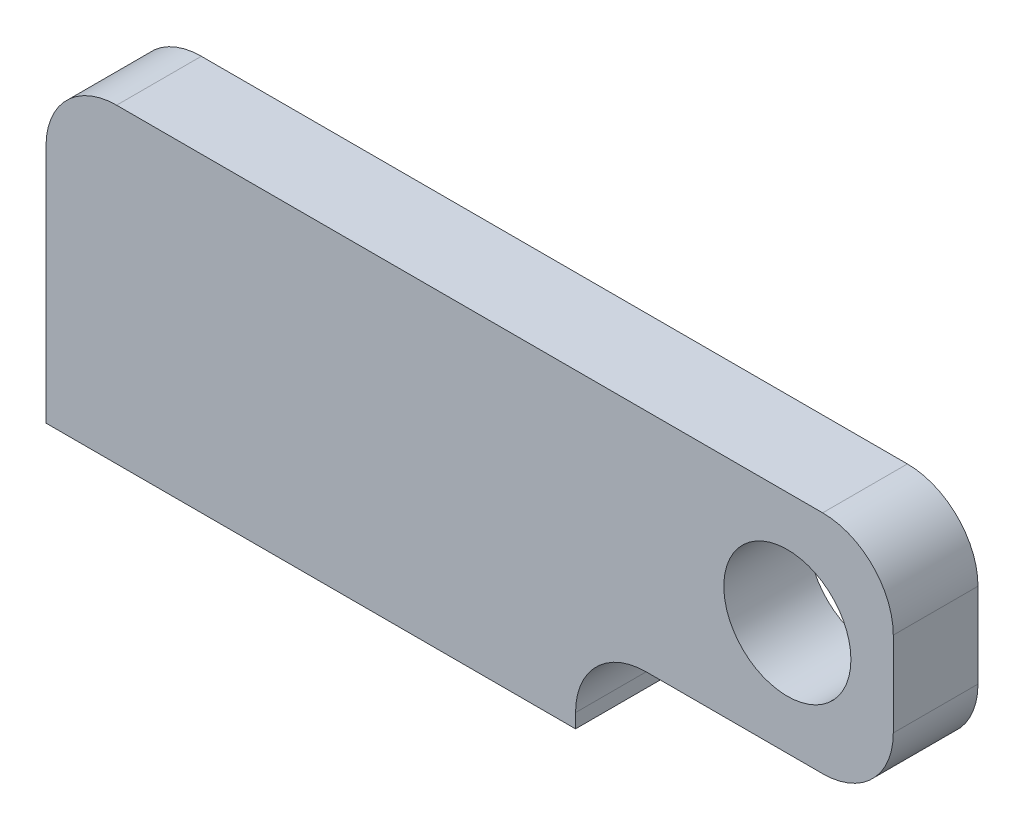
ISO-10303-21;
HEADER;
FILE_DESCRIPTION(('STEP AP214'),'2;1');
FILE_NAME('part.step','',(''),(''),'','','');
FILE_SCHEMA(('AUTOMOTIVE_DESIGN { 1 0 10303 214 1 1 1 1 }'));
ENDSEC;
DATA;
#1=APPLICATION_CONTEXT('core data for automotive mechanical design processes');
#2=APPLICATION_PROTOCOL_DEFINITION('international standard','automotive_design',2000,#1);
#3=PRODUCT_CONTEXT('',#1,'mechanical');
#4=PRODUCT('Part','Part','',(#3));
#5=PRODUCT_RELATED_PRODUCT_CATEGORY('part','',(#4));
#6=PRODUCT_DEFINITION_FORMATION('','',#4);
#7=PRODUCT_DEFINITION_CONTEXT('part definition',#1,'design');
#8=PRODUCT_DEFINITION('design','',#6,#7);
#9=PRODUCT_DEFINITION_SHAPE('','',#8);
#10=(LENGTH_UNIT() NAMED_UNIT(*) SI_UNIT(.MILLI.,.METRE.));
#11=(NAMED_UNIT(*) PLANE_ANGLE_UNIT() SI_UNIT($,.RADIAN.));
#12=(NAMED_UNIT(*) SI_UNIT($,.STERADIAN.) SOLID_ANGLE_UNIT());
#13=UNCERTAINTY_MEASURE_WITH_UNIT(LENGTH_MEASURE(1.E-05),#10,'distance_accuracy_value','');
#14=(GEOMETRIC_REPRESENTATION_CONTEXT(3) GLOBAL_UNCERTAINTY_ASSIGNED_CONTEXT((#13)) GLOBAL_UNIT_ASSIGNED_CONTEXT((#10,
#11,#12)) REPRESENTATION_CONTEXT('',''));
#15=CARTESIAN_POINT('',(0.,0.,0.));
#16=DIRECTION('',(0.,0.,1.));
#17=DIRECTION('',(1.,0.,0.));
#18=AXIS2_PLACEMENT_3D('',#15,#16,#17);
#19=CARTESIAN_POINT('',(0.,0.,6.));
#20=DIRECTION('',(1.,0.,0.));
#21=DIRECTION('',(0.,0.,-1.));
#22=AXIS2_PLACEMENT_3D('',#19,#20,#21);
#23=PLANE('',#22);
#24=DIRECTION('',(0.,-1.,0.));
#25=VECTOR('',#24,1.);
#26=CARTESIAN_POINT('',(0.,0.,6.));
#27=LINE('',#26,#25);
#28=CARTESIAN_POINT('',(0.,34.,6.));
#29=VERTEX_POINT('',#28);
#30=CARTESIAN_POINT('',(0.,0.,6.));
#31=VERTEX_POINT('',#30);
#32=EDGE_CURVE('E144',#29,#31,#27,.T.);
#33=ORIENTED_EDGE('',*,*,#32,.F.);
#34=DIRECTION('',(0.,0.,-1.));
#35=VECTOR('',#34,1.);
#36=CARTESIAN_POINT('',(0.,34.,6.));
#37=LINE('',#36,#35);
#38=CARTESIAN_POINT('',(0.,34.,-6.));
#39=VERTEX_POINT('',#38);
#40=EDGE_CURVE('E178',#29,#39,#37,.T.);
#41=ORIENTED_EDGE('',*,*,#40,.T.);
#42=DIRECTION('',(0.,-1.,0.));
#43=VECTOR('',#42,1.);
#44=CARTESIAN_POINT('',(0.,0.,-6.));
#45=LINE('',#44,#43);
#46=CARTESIAN_POINT('',(0.,0.,-6.));
#47=VERTEX_POINT('',#46);
#48=EDGE_CURVE('E143',#39,#47,#45,.T.);
#49=ORIENTED_EDGE('',*,*,#48,.T.);
#50=DIRECTION('',(0.,0.,-1.));
#51=VECTOR('',#50,1.);
#52=CARTESIAN_POINT('',(0.,0.,6.));
#53=LINE('',#52,#51);
#54=EDGE_CURVE('E175',#31,#47,#53,.T.);
#55=ORIENTED_EDGE('',*,*,#54,.F.);
#56=EDGE_LOOP('',(#33,#41,#49,#55));
#57=FACE_BOUND('',#56,.T.);
#58=ADVANCED_FACE('F38',(#57),#23,.F.);
#59=CARTESIAN_POINT('',(0.,0.,6.));
#60=DIRECTION('',(0.,1.,0.));
#61=DIRECTION('',(0.,0.,1.));
#62=AXIS2_PLACEMENT_3D('',#59,#60,#61);
#63=PLANE('',#62);
#64=CARTESIAN_POINT('',(10.,0.,0.));
#65=DIRECTION('',(0.,-1.,0.));
#66=DIRECTION('',(0.,0.,-1.));
#67=AXIS2_PLACEMENT_3D('',#64,#65,#66);
#68=CIRCLE('',#67,2.49999999999999);
#69=CARTESIAN_POINT('',(10.,0.,-2.49999999999999));
#70=VERTEX_POINT('',#69);
#71=EDGE_CURVE('E131',#70,#70,#68,.T.);
#72=ORIENTED_EDGE('',*,*,#71,.F.);
#73=EDGE_LOOP('',(#72));
#74=FACE_BOUND('',#73,.T.);
#75=CARTESIAN_POINT('',(65.,0.,0.));
#76=DIRECTION('',(0.,-1.,0.));
#77=DIRECTION('',(0.,0.,-1.));
#78=AXIS2_PLACEMENT_3D('',#75,#76,#77);
#79=CIRCLE('',#78,2.49999999999999);
#80=CARTESIAN_POINT('',(65.,0.,-2.49999999999998));
#81=VERTEX_POINT('',#80);
#82=EDGE_CURVE('E130',#81,#81,#79,.T.);
#83=ORIENTED_EDGE('',*,*,#82,.F.);
#84=EDGE_LOOP('',(#83));
#85=FACE_BOUND('',#84,.T.);
#86=DIRECTION('',(1.,0.,0.));
#87=VECTOR('',#86,1.);
#88=CARTESIAN_POINT('',(0.,0.,-6.));
#89=LINE('',#88,#87);
#90=CARTESIAN_POINT('',(75.,0.,-6.));
#91=VERTEX_POINT('',#90);
#92=EDGE_CURVE('E161',#47,#91,#89,.T.);
#93=ORIENTED_EDGE('',*,*,#92,.T.);
#94=DIRECTION('',(0.,0.,-1.));
#95=VECTOR('',#94,1.);
#96=CARTESIAN_POINT('',(75.,0.,6.));
#97=LINE('',#96,#95);
#98=CARTESIAN_POINT('',(75.,0.,6.));
#99=VERTEX_POINT('',#98);
#100=EDGE_CURVE('E159',#99,#91,#97,.T.);
#101=ORIENTED_EDGE('',*,*,#100,.F.);
#102=DIRECTION('',(1.,0.,0.));
#103=VECTOR('',#102,1.);
#104=CARTESIAN_POINT('',(0.,0.,6.));
#105=LINE('',#104,#103);
#106=EDGE_CURVE('E146',#31,#99,#105,.T.);
#107=ORIENTED_EDGE('',*,*,#106,.F.);
#108=ORIENTED_EDGE('',*,*,#54,.T.);
#109=EDGE_LOOP('',(#93,#101,#107,#108));
#110=FACE_BOUND('',#109,.T.);
#111=ADVANCED_FACE('F249',(#74,#85,#110),#63,.F.);
#112=CARTESIAN_POINT('',(75.,0.,6.));
#113=DIRECTION('',(-1.,0.,0.));
#114=DIRECTION('',(0.,0.,1.));
#115=AXIS2_PLACEMENT_3D('',#112,#113,#114);
#116=PLANE('',#115);
#117=DIRECTION('',(0.,1.,0.));
#118=VECTOR('',#117,1.);
#119=CARTESIAN_POINT('',(75.,0.,-6.));
#120=LINE('',#119,#118);
#121=CARTESIAN_POINT('',(75.,2.,-6.));
#122=VERTEX_POINT('',#121);
#123=EDGE_CURVE('E163',#91,#122,#120,.T.);
#124=ORIENTED_EDGE('',*,*,#123,.T.);
#125=DIRECTION('',(0.,0.,-1.));
#126=VECTOR('',#125,1.);
#127=CARTESIAN_POINT('',(75.,2.,6.));
#128=LINE('',#127,#126);
#129=CARTESIAN_POINT('',(75.,2.,6.));
#130=VERTEX_POINT('',#129);
#131=EDGE_CURVE('E202',#122,#130,#128,.F.);
#132=ORIENTED_EDGE('',*,*,#131,.T.);
#133=DIRECTION('',(0.,1.,0.));
#134=VECTOR('',#133,1.);
#135=CARTESIAN_POINT('',(75.,0.,6.));
#136=LINE('',#135,#134);
#137=EDGE_CURVE('E149',#99,#130,#136,.T.);
#138=ORIENTED_EDGE('',*,*,#137,.F.);
#139=ORIENTED_EDGE('',*,*,#100,.T.);
#140=EDGE_LOOP('',(#124,#132,#138,#139));
#141=FACE_BOUND('',#140,.T.);
#142=ADVANCED_FACE('F217',(#141),#116,.F.);
#143=CARTESIAN_POINT('',(75.,12.,6.));
#144=DIRECTION('',(0.,1.,0.));
#145=DIRECTION('',(0.,0.,1.));
#146=AXIS2_PLACEMENT_3D('',#143,#144,#145);
#147=PLANE('',#146);
#148=DIRECTION('',(1.,0.,0.));
#149=VECTOR('',#148,1.);
#150=CARTESIAN_POINT('',(75.,12.,6.));
#151=LINE('',#150,#149);
#152=CARTESIAN_POINT('',(85.,12.,6.));
#153=VERTEX_POINT('',#152);
#154=CARTESIAN_POINT('',(110.,12.,6.));
#155=VERTEX_POINT('',#154);
#156=EDGE_CURVE('E152',#153,#155,#151,.T.);
#157=ORIENTED_EDGE('',*,*,#156,.F.);
#158=DIRECTION('',(0.,0.,-1.));
#159=VECTOR('',#158,1.);
#160=CARTESIAN_POINT('',(85.,12.,-6.));
#161=LINE('',#160,#159);
#162=CARTESIAN_POINT('',(85.,12.,-6.));
#163=VERTEX_POINT('',#162);
#164=EDGE_CURVE('E199',#153,#163,#161,.T.);
#165=ORIENTED_EDGE('',*,*,#164,.T.);
#166=DIRECTION('',(1.,0.,0.));
#167=VECTOR('',#166,1.);
#168=CARTESIAN_POINT('',(75.,12.,-6.));
#169=LINE('',#168,#167);
#170=CARTESIAN_POINT('',(110.,12.,-6.));
#171=VERTEX_POINT('',#170);
#172=EDGE_CURVE('E166',#163,#171,#169,.T.);
#173=ORIENTED_EDGE('',*,*,#172,.T.);
#174=DIRECTION('',(0.,0.,-1.));
#175=VECTOR('',#174,1.);
#176=CARTESIAN_POINT('',(110.,12.,6.));
#177=LINE('',#176,#175);
#178=EDGE_CURVE('E197',#171,#155,#177,.F.);
#179=ORIENTED_EDGE('',*,*,#178,.T.);
#180=EDGE_LOOP('',(#157,#165,#173,#179));
#181=FACE_BOUND('',#180,.T.);
#182=ADVANCED_FACE('F225',(#181),#147,.F.);
#183=CARTESIAN_POINT('',(120.,44.,6.));
#184=DIRECTION('',(-1.,0.,0.));
#185=DIRECTION('',(0.,0.,1.));
#186=AXIS2_PLACEMENT_3D('',#183,#184,#185);
#187=PLANE('',#186);
#188=DIRECTION('',(0.,1.,0.));
#189=VECTOR('',#188,1.);
#190=CARTESIAN_POINT('',(120.,44.,6.));
#191=LINE('',#190,#189);
#192=CARTESIAN_POINT('',(120.,22.,6.));
#193=VERTEX_POINT('',#192);
#194=CARTESIAN_POINT('',(120.,34.,6.));
#195=VERTEX_POINT('',#194);
#196=EDGE_CURVE('E154',#193,#195,#191,.T.);
#197=ORIENTED_EDGE('',*,*,#196,.F.);
#198=DIRECTION('',(0.,0.,-1.));
#199=VECTOR('',#198,1.);
#200=CARTESIAN_POINT('',(120.,22.,6.));
#201=LINE('',#200,#199);
#202=CARTESIAN_POINT('',(120.,22.,-6.));
#203=VERTEX_POINT('',#202);
#204=EDGE_CURVE('E205',#193,#203,#201,.T.);
#205=ORIENTED_EDGE('',*,*,#204,.T.);
#206=DIRECTION('',(0.,1.,0.));
#207=VECTOR('',#206,1.);
#208=CARTESIAN_POINT('',(120.,44.,-6.));
#209=LINE('',#208,#207);
#210=CARTESIAN_POINT('',(120.,34.,-6.));
#211=VERTEX_POINT('',#210);
#212=EDGE_CURVE('E169',#203,#211,#209,.T.);
#213=ORIENTED_EDGE('',*,*,#212,.T.);
#214=DIRECTION('',(0.,0.,-1.));
#215=VECTOR('',#214,1.);
#216=CARTESIAN_POINT('',(120.,34.,6.));
#217=LINE('',#216,#215);
#218=EDGE_CURVE('E53',#211,#195,#217,.F.);
#219=ORIENTED_EDGE('',*,*,#218,.T.);
#220=EDGE_LOOP('',(#197,#205,#213,#219));
#221=FACE_BOUND('',#220,.T.);
#222=ADVANCED_FACE('F231',(#221),#187,.F.);
#223=CARTESIAN_POINT('',(0.,44.,6.));
#224=DIRECTION('',(0.,-1.,0.));
#225=DIRECTION('',(0.,0.,-1.));
#226=AXIS2_PLACEMENT_3D('',#223,#224,#225);
#227=PLANE('',#226);
#228=DIRECTION('',(-1.,0.,0.));
#229=VECTOR('',#228,1.);
#230=CARTESIAN_POINT('',(0.,44.,-6.));
#231=LINE('',#230,#229);
#232=CARTESIAN_POINT('',(110.,44.,-6.));
#233=VERTEX_POINT('',#232);
#234=CARTESIAN_POINT('',(10.,44.,-6.));
#235=VERTEX_POINT('',#234);
#236=EDGE_CURVE('E147',#233,#235,#231,.T.);
#237=ORIENTED_EDGE('',*,*,#236,.T.);
#238=DIRECTION('',(0.,0.,-1.));
#239=VECTOR('',#238,1.);
#240=CARTESIAN_POINT('',(10.,44.,6.));
#241=LINE('',#240,#239);
#242=CARTESIAN_POINT('',(10.,44.,6.));
#243=VERTEX_POINT('',#242);
#244=EDGE_CURVE('E190',#235,#243,#241,.F.);
#245=ORIENTED_EDGE('',*,*,#244,.T.);
#246=DIRECTION('',(-1.,0.,0.));
#247=VECTOR('',#246,1.);
#248=CARTESIAN_POINT('',(0.,44.,6.));
#249=LINE('',#248,#247);
#250=CARTESIAN_POINT('',(110.,44.,6.));
#251=VERTEX_POINT('',#250);
#252=EDGE_CURVE('E156',#251,#243,#249,.T.);
#253=ORIENTED_EDGE('',*,*,#252,.F.);
#254=DIRECTION('',(0.,0.,-1.));
#255=VECTOR('',#254,1.);
#256=CARTESIAN_POINT('',(110.,44.,6.));
#257=LINE('',#256,#255);
#258=EDGE_CURVE('E187',#251,#233,#257,.T.);
#259=ORIENTED_EDGE('',*,*,#258,.T.);
#260=EDGE_LOOP('',(#237,#245,#253,#259));
#261=FACE_BOUND('',#260,.T.);
#262=ADVANCED_FACE('F238',(#261),#227,.F.);
#263=CARTESIAN_POINT('',(0.,0.,6.));
#264=DIRECTION('',(0.,0.,-1.));
#265=DIRECTION('',(-1.,0.,0.));
#266=AXIS2_PLACEMENT_3D('',#263,#264,#265);
#267=PLANE('',#266);
#268=CARTESIAN_POINT('',(105.,28.,6.));
#269=DIRECTION('',(0.,0.,1.));
#270=DIRECTION('',(1.,0.,0.));
#271=AXIS2_PLACEMENT_3D('',#268,#269,#270);
#272=CIRCLE('',#271,9.);
#273=CARTESIAN_POINT('',(114.,28.,6.));
#274=VERTEX_POINT('',#273);
#275=EDGE_CURVE('E410',#274,#274,#272,.T.);
#276=ORIENTED_EDGE('',*,*,#275,.F.);
#277=EDGE_LOOP('',(#276));
#278=FACE_BOUND('',#277,.T.);
#279=ORIENTED_EDGE('',*,*,#252,.T.);
#280=CARTESIAN_POINT('',(10.,34.,6.));
#281=DIRECTION('',(0.,0.,-1.));
#282=DIRECTION('',(-1.,0.,0.));
#283=AXIS2_PLACEMENT_3D('',#280,#281,#282);
#284=CIRCLE('',#283,10.);
#285=EDGE_CURVE('E195',#243,#29,#284,.F.);
#286=ORIENTED_EDGE('',*,*,#285,.T.);
#287=ORIENTED_EDGE('',*,*,#32,.T.);
#288=ORIENTED_EDGE('',*,*,#106,.T.);
#289=ORIENTED_EDGE('',*,*,#137,.T.);
#290=CARTESIAN_POINT('',(85.,2.,6.));
#291=DIRECTION('',(0.,0.,-1.));
#292=DIRECTION('',(-1.,0.,0.));
#293=AXIS2_PLACEMENT_3D('',#290,#291,#292);
#294=CIRCLE('',#293,10.);
#295=EDGE_CURVE('E11',#130,#153,#294,.T.);
#296=ORIENTED_EDGE('',*,*,#295,.T.);
#297=ORIENTED_EDGE('',*,*,#156,.T.);
#298=CARTESIAN_POINT('',(110.,22.,6.));
#299=DIRECTION('',(0.,0.,-1.));
#300=DIRECTION('',(-1.,0.,0.));
#301=AXIS2_PLACEMENT_3D('',#298,#299,#300);
#302=CIRCLE('',#301,10.);
#303=EDGE_CURVE('E60',#155,#193,#302,.F.);
#304=ORIENTED_EDGE('',*,*,#303,.T.);
#305=ORIENTED_EDGE('',*,*,#196,.T.);
#306=CARTESIAN_POINT('',(110.,34.,6.));
#307=DIRECTION('',(0.,0.,-1.));
#308=DIRECTION('',(-1.,0.,0.));
#309=AXIS2_PLACEMENT_3D('',#306,#307,#308);
#310=CIRCLE('',#309,10.);
#311=EDGE_CURVE('E192',#195,#251,#310,.F.);
#312=ORIENTED_EDGE('',*,*,#311,.T.);
#313=EDGE_LOOP('',(#279,#286,#287,#288,#289,#296,#297,#304,#305,#312));
#314=FACE_BOUND('',#313,.T.);
#315=ADVANCED_FACE('F223',(#278,#314),#267,.F.);
#316=CARTESIAN_POINT('',(0.,0.,-6.));
#317=DIRECTION('',(0.,0.,-1.));
#318=DIRECTION('',(-1.,0.,0.));
#319=AXIS2_PLACEMENT_3D('',#316,#317,#318);
#320=PLANE('',#319);
#321=CARTESIAN_POINT('',(105.,28.,-6.));
#322=DIRECTION('',(0.,0.,1.));
#323=DIRECTION('',(1.,0.,0.));
#324=AXIS2_PLACEMENT_3D('',#321,#322,#323);
#325=CIRCLE('',#324,9.);
#326=CARTESIAN_POINT('',(114.,28.,-6.));
#327=VERTEX_POINT('',#326);
#328=EDGE_CURVE('E137',#327,#327,#325,.T.);
#329=ORIENTED_EDGE('',*,*,#328,.T.);
#330=EDGE_LOOP('',(#329));
#331=FACE_BOUND('',#330,.T.);
#332=ORIENTED_EDGE('',*,*,#48,.F.);
#333=CARTESIAN_POINT('',(10.,34.,-6.));
#334=DIRECTION('',(0.,0.,-1.));
#335=DIRECTION('',(-1.,0.,0.));
#336=AXIS2_PLACEMENT_3D('',#333,#334,#335);
#337=CIRCLE('',#336,10.);
#338=EDGE_CURVE('E185',#39,#235,#337,.T.);
#339=ORIENTED_EDGE('',*,*,#338,.T.);
#340=ORIENTED_EDGE('',*,*,#236,.F.);
#341=CARTESIAN_POINT('',(110.,34.,-6.));
#342=DIRECTION('',(0.,0.,-1.));
#343=DIRECTION('',(-1.,0.,0.));
#344=AXIS2_PLACEMENT_3D('',#341,#342,#343);
#345=CIRCLE('',#344,10.);
#346=EDGE_CURVE('E181',#233,#211,#345,.T.);
#347=ORIENTED_EDGE('',*,*,#346,.T.);
#348=ORIENTED_EDGE('',*,*,#212,.F.);
#349=CARTESIAN_POINT('',(110.,22.,-6.));
#350=DIRECTION('',(0.,0.,-1.));
#351=DIRECTION('',(-1.,0.,0.));
#352=AXIS2_PLACEMENT_3D('',#349,#350,#351);
#353=CIRCLE('',#352,10.);
#354=EDGE_CURVE('E183',#203,#171,#353,.T.);
#355=ORIENTED_EDGE('',*,*,#354,.T.);
#356=ORIENTED_EDGE('',*,*,#172,.F.);
#357=CARTESIAN_POINT('',(85.,2.,-6.));
#358=DIRECTION('',(0.,0.,-1.));
#359=DIRECTION('',(-1.,0.,0.));
#360=AXIS2_PLACEMENT_3D('',#357,#358,#359);
#361=CIRCLE('',#360,10.);
#362=EDGE_CURVE('E46',#163,#122,#361,.F.);
#363=ORIENTED_EDGE('',*,*,#362,.T.);
#364=ORIENTED_EDGE('',*,*,#123,.F.);
#365=ORIENTED_EDGE('',*,*,#92,.F.);
#366=EDGE_LOOP('',(#332,#339,#340,#347,#348,#355,#356,#363,#364,#365));
#367=FACE_BOUND('',#366,.T.);
#368=ADVANCED_FACE('F211',(#331,#367),#320,.T.);
#369=CARTESIAN_POINT('',(65.,18.,0.));
#370=DIRECTION('',(0.,-1.,0.));
#371=DIRECTION('',(0.,0.,-1.));
#372=AXIS2_PLACEMENT_3D('',#369,#370,#371);
#373=CONICAL_SURFACE('',#372,2.5,1.02974425867665);
#374=CARTESIAN_POINT('',(65.,19.5021515475689,0.));
#375=VERTEX_POINT('',#374);
#376=VERTEX_LOOP('',#375);
#377=FACE_BOUND('',#376,.T.);
#378=CARTESIAN_POINT('',(65.,18.,0.));
#379=DIRECTION('',(0.,-1.,0.));
#380=DIRECTION('',(0.,0.,-1.));
#381=AXIS2_PLACEMENT_3D('',#378,#379,#380);
#382=CIRCLE('',#381,2.5);
#383=CARTESIAN_POINT('',(65.,18.,-2.5));
#384=VERTEX_POINT('',#383);
#385=EDGE_CURVE('E134',#384,#384,#382,.T.);
#386=ORIENTED_EDGE('',*,*,#385,.T.);
#387=EDGE_LOOP('',(#386));
#388=FACE_BOUND('',#387,.T.);
#389=ADVANCED_FACE('F300',(#377,#388),#373,.F.);
#390=CARTESIAN_POINT('',(65.,0.,0.));
#391=DIRECTION('',(0.,-1.,0.));
#392=DIRECTION('',(0.,0.,-1.));
#393=AXIS2_PLACEMENT_3D('',#390,#391,#392);
#394=CYLINDRICAL_SURFACE('',#393,2.5);
#395=ORIENTED_EDGE('',*,*,#385,.F.);
#396=EDGE_LOOP('',(#395));
#397=FACE_BOUND('',#396,.T.);
#398=ORIENTED_EDGE('',*,*,#82,.T.);
#399=EDGE_LOOP('',(#398));
#400=FACE_BOUND('',#399,.T.);
#401=ADVANCED_FACE('F124',(#397,#400),#394,.F.);
#402=CARTESIAN_POINT('',(10.,18.,0.));
#403=DIRECTION('',(0.,-1.,0.));
#404=DIRECTION('',(0.,0.,-1.));
#405=AXIS2_PLACEMENT_3D('',#402,#403,#404);
#406=CONICAL_SURFACE('',#405,2.5,1.02974425867665);
#407=CARTESIAN_POINT('',(9.99999999999999,19.5021515475689,0.));
#408=VERTEX_POINT('',#407);
#409=VERTEX_LOOP('',#408);
#410=FACE_BOUND('',#409,.T.);
#411=CARTESIAN_POINT('',(10.,18.,0.));
#412=DIRECTION('',(0.,-1.,0.));
#413=DIRECTION('',(0.,0.,-1.));
#414=AXIS2_PLACEMENT_3D('',#411,#412,#413);
#415=CIRCLE('',#414,2.5);
#416=CARTESIAN_POINT('',(10.,18.,-2.49999999999999));
#417=VERTEX_POINT('',#416);
#418=EDGE_CURVE('E128',#417,#417,#415,.T.);
#419=ORIENTED_EDGE('',*,*,#418,.T.);
#420=EDGE_LOOP('',(#419));
#421=FACE_BOUND('',#420,.T.);
#422=ADVANCED_FACE('F120',(#410,#421),#406,.F.);
#423=CARTESIAN_POINT('',(10.,0.,0.));
#424=DIRECTION('',(0.,-1.,0.));
#425=DIRECTION('',(0.,0.,-1.));
#426=AXIS2_PLACEMENT_3D('',#423,#424,#425);
#427=CYLINDRICAL_SURFACE('',#426,2.49999999999999);
#428=ORIENTED_EDGE('',*,*,#418,.F.);
#429=EDGE_LOOP('',(#428));
#430=FACE_BOUND('',#429,.T.);
#431=ORIENTED_EDGE('',*,*,#71,.T.);
#432=EDGE_LOOP('',(#431));
#433=FACE_BOUND('',#432,.T.);
#434=ADVANCED_FACE('F123',(#430,#433),#427,.F.);
#435=CARTESIAN_POINT('',(105.,28.,-6.));
#436=DIRECTION('',(0.,0.,1.));
#437=DIRECTION('',(1.,0.,0.));
#438=AXIS2_PLACEMENT_3D('',#435,#436,#437);
#439=CYLINDRICAL_SURFACE('',#438,9.);
#440=ORIENTED_EDGE('',*,*,#328,.F.);
#441=EDGE_LOOP('',(#440));
#442=FACE_BOUND('',#441,.T.);
#443=ORIENTED_EDGE('',*,*,#275,.T.);
#444=EDGE_LOOP('',(#443));
#445=FACE_BOUND('',#444,.T.);
#446=ADVANCED_FACE('F265',(#442,#445),#439,.F.);
#447=CARTESIAN_POINT('',(10.,34.,6.));
#448=DIRECTION('',(0.,0.,-1.));
#449=DIRECTION('',(-1.,0.,0.));
#450=AXIS2_PLACEMENT_3D('',#447,#448,#449);
#451=CYLINDRICAL_SURFACE('',#450,10.);
#452=ORIENTED_EDGE('',*,*,#285,.F.);
#453=ORIENTED_EDGE('',*,*,#244,.F.);
#454=ORIENTED_EDGE('',*,*,#338,.F.);
#455=ORIENTED_EDGE('',*,*,#40,.F.);
#456=EDGE_LOOP('',(#452,#453,#454,#455));
#457=FACE_BOUND('',#456,.T.);
#458=ADVANCED_FACE('F244',(#457),#451,.T.);
#459=CARTESIAN_POINT('',(85.,2.,6.));
#460=DIRECTION('',(0.,0.,1.));
#461=DIRECTION('',(1.,0.,0.));
#462=AXIS2_PLACEMENT_3D('',#459,#460,#461);
#463=CYLINDRICAL_SURFACE('',#462,10.);
#464=ORIENTED_EDGE('',*,*,#295,.F.);
#465=ORIENTED_EDGE('',*,*,#131,.F.);
#466=ORIENTED_EDGE('',*,*,#362,.F.);
#467=ORIENTED_EDGE('',*,*,#164,.F.);
#468=EDGE_LOOP('',(#464,#465,#466,#467));
#469=FACE_BOUND('',#468,.T.);
#470=ADVANCED_FACE('F221',(#469),#463,.F.);
#471=CARTESIAN_POINT('',(110.,22.,6.));
#472=DIRECTION('',(0.,0.,-1.));
#473=DIRECTION('',(-1.,0.,0.));
#474=AXIS2_PLACEMENT_3D('',#471,#472,#473);
#475=CYLINDRICAL_SURFACE('',#474,10.);
#476=ORIENTED_EDGE('',*,*,#303,.F.);
#477=ORIENTED_EDGE('',*,*,#178,.F.);
#478=ORIENTED_EDGE('',*,*,#354,.F.);
#479=ORIENTED_EDGE('',*,*,#204,.F.);
#480=EDGE_LOOP('',(#476,#477,#478,#479));
#481=FACE_BOUND('',#480,.T.);
#482=ADVANCED_FACE('F228',(#481),#475,.T.);
#483=CARTESIAN_POINT('',(110.,34.,6.));
#484=DIRECTION('',(0.,0.,-1.));
#485=DIRECTION('',(-1.,0.,0.));
#486=AXIS2_PLACEMENT_3D('',#483,#484,#485);
#487=CYLINDRICAL_SURFACE('',#486,10.);
#488=ORIENTED_EDGE('',*,*,#311,.F.);
#489=ORIENTED_EDGE('',*,*,#218,.F.);
#490=ORIENTED_EDGE('',*,*,#346,.F.);
#491=ORIENTED_EDGE('',*,*,#258,.F.);
#492=EDGE_LOOP('',(#488,#489,#490,#491));
#493=FACE_BOUND('',#492,.T.);
#494=ADVANCED_FACE('F40',(#493),#487,.T.);
#495=CLOSED_SHELL('',(#58,#111,#142,#182,#222,#262,#315,#368,#389,#401,#422,#434,#446,#458,#470,
#482,#494));
#496=MANIFOLD_SOLID_BREP('B2',#495);
#497=ADVANCED_BREP_SHAPE_REPRESENTATION('',(#18,#496),#14);
#498=SHAPE_DEFINITION_REPRESENTATION(#9,#497);
ENDSEC;
END-ISO-10303-21;
